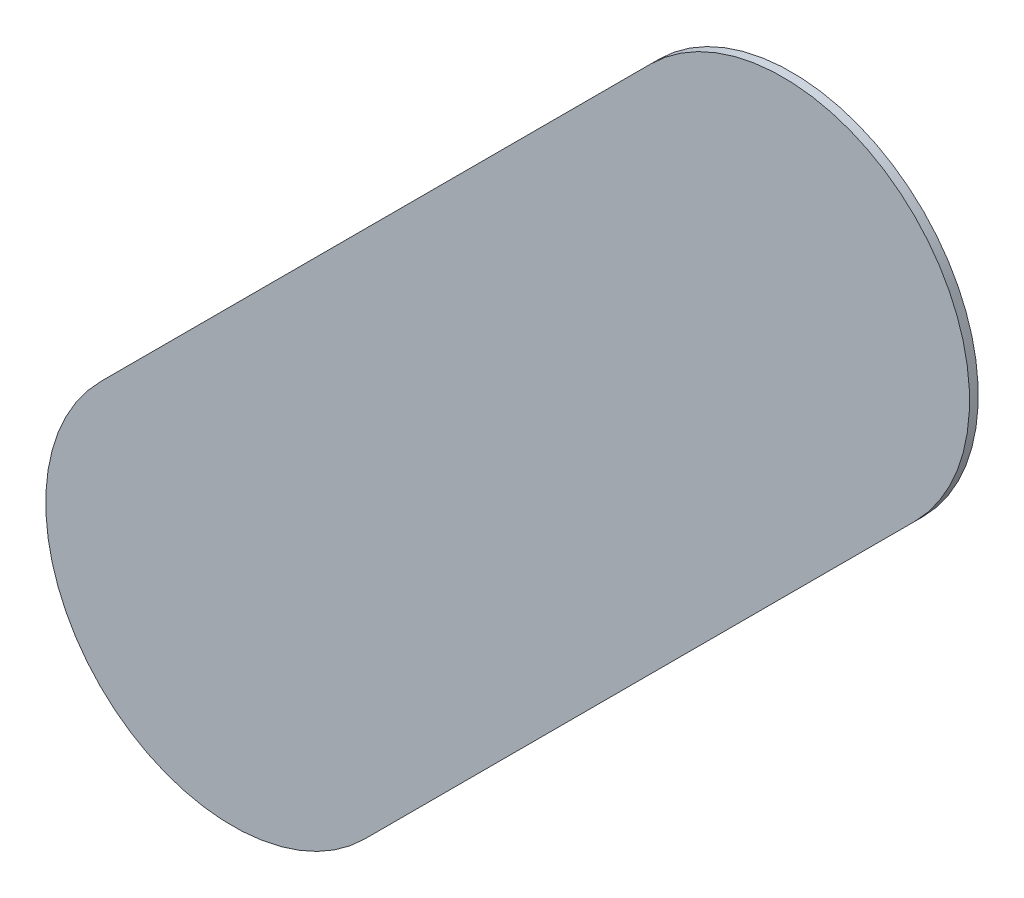
ISO-10303-21;
HEADER;
FILE_DESCRIPTION(('STEP AP214'),'2;1');
FILE_NAME('part.step','',(''),(''),'','','');
FILE_SCHEMA(('AUTOMOTIVE_DESIGN { 1 0 10303 214 1 1 1 1 }'));
ENDSEC;
DATA;
#1=APPLICATION_CONTEXT('core data for automotive mechanical design processes');
#2=APPLICATION_PROTOCOL_DEFINITION('international standard','automotive_design',2000,#1);
#3=PRODUCT_CONTEXT('',#1,'mechanical');
#4=PRODUCT('Part','Part','',(#3));
#5=PRODUCT_RELATED_PRODUCT_CATEGORY('part','',(#4));
#6=PRODUCT_DEFINITION_FORMATION('','',#4);
#7=PRODUCT_DEFINITION_CONTEXT('part definition',#1,'design');
#8=PRODUCT_DEFINITION('design','',#6,#7);
#9=PRODUCT_DEFINITION_SHAPE('','',#8);
#10=(LENGTH_UNIT() NAMED_UNIT(*) SI_UNIT(.MILLI.,.METRE.));
#11=(NAMED_UNIT(*) PLANE_ANGLE_UNIT() SI_UNIT($,.RADIAN.));
#12=(NAMED_UNIT(*) SI_UNIT($,.STERADIAN.) SOLID_ANGLE_UNIT());
#13=UNCERTAINTY_MEASURE_WITH_UNIT(LENGTH_MEASURE(1.E-05),#10,'distance_accuracy_value','');
#14=(GEOMETRIC_REPRESENTATION_CONTEXT(3) GLOBAL_UNCERTAINTY_ASSIGNED_CONTEXT((#13)) GLOBAL_UNIT_ASSIGNED_CONTEXT((#10,
#11,#12)) REPRESENTATION_CONTEXT('',''));
#15=CARTESIAN_POINT('',(0.,0.,0.));
#16=DIRECTION('',(0.,0.,1.));
#17=DIRECTION('',(1.,0.,0.));
#18=AXIS2_PLACEMENT_3D('',#15,#16,#17);
#19=CARTESIAN_POINT('',(156.111669,-120.703669,0.));
#20=DIRECTION('',(0.,0.,1.));
#21=DIRECTION('',(1.,0.,0.));
#22=AXIS2_PLACEMENT_3D('',#19,#20,#21);
#23=PLANE('',#22);
#24=DIRECTION('',(-0.707106781186548,-0.707106781186548,0.));
#25=VECTOR('',#24,1.);
#26=CARTESIAN_POINT('',(156.111669,-120.703669,0.));
#27=LINE('',#26,#25);
#28=CARTESIAN_POINT('',(156.111669,-120.703669,0.));
#29=VERTEX_POINT('',#28);
#30=CARTESIAN_POINT('',(153.901669,-122.913669,0.));
#31=VERTEX_POINT('',#30);
#32=EDGE_CURVE('E81',#29,#31,#27,.T.);
#33=ORIENTED_EDGE('',*,*,#32,.T.);
#34=CARTESIAN_POINT('',(154.4319995,-123.4439995,0.));
#35=DIRECTION('',(0.,0.,1.));
#36=DIRECTION('',(-0.707106781186548,0.707106781186548,0.));
#37=AXIS2_PLACEMENT_3D('',#34,#35,#36);
#38=CIRCLE('',#37,0.75000058564);
#39=CARTESIAN_POINT('',(154.96233,-123.97433,0.));
#40=VERTEX_POINT('',#39);
#41=EDGE_CURVE('E105',#31,#40,#38,.T.);
#42=ORIENTED_EDGE('',*,*,#41,.T.);
#43=DIRECTION('',(0.707106781186548,0.707106781186548,0.));
#44=VECTOR('',#43,1.);
#45=CARTESIAN_POINT('',(154.96233,-123.97433,0.));
#46=LINE('',#45,#44);
#47=CARTESIAN_POINT('',(157.17233,-121.76433,0.));
#48=VERTEX_POINT('',#47);
#49=EDGE_CURVE('E74',#40,#48,#46,.T.);
#50=ORIENTED_EDGE('',*,*,#49,.T.);
#51=CARTESIAN_POINT('',(156.6419995,-121.2339995,0.));
#52=DIRECTION('',(0.,0.,1.));
#53=DIRECTION('',(0.707106781186548,-0.707106781186548,0.));
#54=AXIS2_PLACEMENT_3D('',#51,#52,#53);
#55=CIRCLE('',#54,0.75000058564);
#56=EDGE_CURVE('E11',#48,#29,#55,.T.);
#57=ORIENTED_EDGE('',*,*,#56,.T.);
#58=EDGE_LOOP('',(#33,#42,#50,#57));
#59=FACE_BOUND('',#58,.T.);
#60=ADVANCED_FACE('F17',(#59),#23,.T.);
#61=CARTESIAN_POINT('',(156.111669,-120.703669,-0.035));
#62=DIRECTION('',(0.,0.,1.));
#63=DIRECTION('',(1.,0.,0.));
#64=AXIS2_PLACEMENT_3D('',#61,#62,#63);
#65=PLANE('',#64);
#66=CARTESIAN_POINT('',(156.6419995,-121.2339995,-0.035));
#67=DIRECTION('',(0.,0.,1.));
#68=DIRECTION('',(0.707106781186548,-0.707106781186548,0.));
#69=AXIS2_PLACEMENT_3D('',#66,#67,#68);
#70=CIRCLE('',#69,0.75000058564);
#71=CARTESIAN_POINT('',(157.17233,-121.76433,-0.035));
#72=VERTEX_POINT('',#71);
#73=CARTESIAN_POINT('',(156.111669,-120.703669,-0.035));
#74=VERTEX_POINT('',#73);
#75=EDGE_CURVE('E25',#72,#74,#70,.T.);
#76=ORIENTED_EDGE('',*,*,#75,.F.);
#77=DIRECTION('',(0.707106781186548,0.707106781186548,0.));
#78=VECTOR('',#77,1.);
#79=CARTESIAN_POINT('',(154.96233,-123.97433,-0.035));
#80=LINE('',#79,#78);
#81=CARTESIAN_POINT('',(154.96233,-123.97433,-0.035));
#82=VERTEX_POINT('',#81);
#83=EDGE_CURVE('E109',#82,#72,#80,.T.);
#84=ORIENTED_EDGE('',*,*,#83,.F.);
#85=CARTESIAN_POINT('',(154.4319995,-123.4439995,-0.035));
#86=DIRECTION('',(0.,0.,1.));
#87=DIRECTION('',(-0.707106781186548,0.707106781186548,0.));
#88=AXIS2_PLACEMENT_3D('',#85,#86,#87);
#89=CIRCLE('',#88,0.75000058564);
#90=CARTESIAN_POINT('',(153.901669,-122.913669,-0.035));
#91=VERTEX_POINT('',#90);
#92=EDGE_CURVE('E83',#91,#82,#89,.T.);
#93=ORIENTED_EDGE('',*,*,#92,.F.);
#94=DIRECTION('',(-0.707106781186548,-0.707106781186548,0.));
#95=VECTOR('',#94,1.);
#96=CARTESIAN_POINT('',(156.111669,-120.703669,-0.035));
#97=LINE('',#96,#95);
#98=EDGE_CURVE('E79',#74,#91,#97,.T.);
#99=ORIENTED_EDGE('',*,*,#98,.F.);
#100=EDGE_LOOP('',(#76,#84,#93,#99));
#101=FACE_BOUND('',#100,.T.);
#102=ADVANCED_FACE('F85',(#101),#65,.F.);
#103=CARTESIAN_POINT('',(156.6419995,-121.2339995,-0.035));
#104=DIRECTION('',(0.,0.,-1.));
#105=DIRECTION('',(0.707106781186548,-0.707106781186548,0.));
#106=AXIS2_PLACEMENT_3D('',#103,#104,#105);
#107=CYLINDRICAL_SURFACE('',#106,0.75000058564);
#108=ORIENTED_EDGE('',*,*,#75,.T.);
#109=DIRECTION('',(0.,0.,1.));
#110=VECTOR('',#109,1.);
#111=CARTESIAN_POINT('',(156.111669,-120.703669,-0.035));
#112=LINE('',#111,#110);
#113=EDGE_CURVE('E68',#74,#29,#112,.T.);
#114=ORIENTED_EDGE('',*,*,#113,.T.);
#115=ORIENTED_EDGE('',*,*,#56,.F.);
#116=DIRECTION('',(0.,0.,1.));
#117=VECTOR('',#116,1.);
#118=CARTESIAN_POINT('',(157.17233,-121.76433,-0.035));
#119=LINE('',#118,#117);
#120=EDGE_CURVE('E71',#72,#48,#119,.T.);
#121=ORIENTED_EDGE('',*,*,#120,.F.);
#122=EDGE_LOOP('',(#108,#114,#115,#121));
#123=FACE_BOUND('',#122,.T.);
#124=ADVANCED_FACE('F67',(#123),#107,.T.);
#125=CARTESIAN_POINT('',(154.96233,-123.97433,-0.035));
#126=DIRECTION('',(-0.707106781186548,0.707106781186548,0.));
#127=DIRECTION('',(0.,0.,1.));
#128=AXIS2_PLACEMENT_3D('',#125,#126,#127);
#129=PLANE('',#128);
#130=ORIENTED_EDGE('',*,*,#83,.T.);
#131=ORIENTED_EDGE('',*,*,#120,.T.);
#132=ORIENTED_EDGE('',*,*,#49,.F.);
#133=DIRECTION('',(0.,0.,1.));
#134=VECTOR('',#133,1.);
#135=CARTESIAN_POINT('',(154.96233,-123.97433,-0.035));
#136=LINE('',#135,#134);
#137=EDGE_CURVE('E100',#82,#40,#136,.T.);
#138=ORIENTED_EDGE('',*,*,#137,.F.);
#139=EDGE_LOOP('',(#130,#131,#132,#138));
#140=FACE_BOUND('',#139,.T.);
#141=ADVANCED_FACE('F120',(#140),#129,.F.);
#142=CARTESIAN_POINT('',(154.4319995,-123.4439995,-0.035));
#143=DIRECTION('',(0.,0.,-1.));
#144=DIRECTION('',(-0.707106781186548,0.707106781186548,0.));
#145=AXIS2_PLACEMENT_3D('',#142,#143,#144);
#146=CYLINDRICAL_SURFACE('',#145,0.75000058564);
#147=ORIENTED_EDGE('',*,*,#92,.T.);
#148=ORIENTED_EDGE('',*,*,#137,.T.);
#149=ORIENTED_EDGE('',*,*,#41,.F.);
#150=DIRECTION('',(0.,0.,1.));
#151=VECTOR('',#150,1.);
#152=CARTESIAN_POINT('',(153.901669,-122.913669,-0.035));
#153=LINE('',#152,#151);
#154=EDGE_CURVE('E89',#91,#31,#153,.T.);
#155=ORIENTED_EDGE('',*,*,#154,.F.);
#156=EDGE_LOOP('',(#147,#148,#149,#155));
#157=FACE_BOUND('',#156,.T.);
#158=ADVANCED_FACE('F122',(#157),#146,.T.);
#159=CARTESIAN_POINT('',(156.111669,-120.703669,-0.035));
#160=DIRECTION('',(0.707106781186548,-0.707106781186548,0.));
#161=DIRECTION('',(0.,0.,-1.));
#162=AXIS2_PLACEMENT_3D('',#159,#160,#161);
#163=PLANE('',#162);
#164=ORIENTED_EDGE('',*,*,#98,.T.);
#165=ORIENTED_EDGE('',*,*,#154,.T.);
#166=ORIENTED_EDGE('',*,*,#32,.F.);
#167=ORIENTED_EDGE('',*,*,#113,.F.);
#168=EDGE_LOOP('',(#164,#165,#166,#167));
#169=FACE_BOUND('',#168,.T.);
#170=ADVANCED_FACE('F77',(#169),#163,.F.);
#171=CLOSED_SHELL('',(#60,#102,#124,#141,#158,#170));
#172=MANIFOLD_SOLID_BREP('B1',#171);
#173=ADVANCED_BREP_SHAPE_REPRESENTATION('',(#18,#172),#14);
#174=SHAPE_DEFINITION_REPRESENTATION(#9,#173);
ENDSEC;
END-ISO-10303-21;
